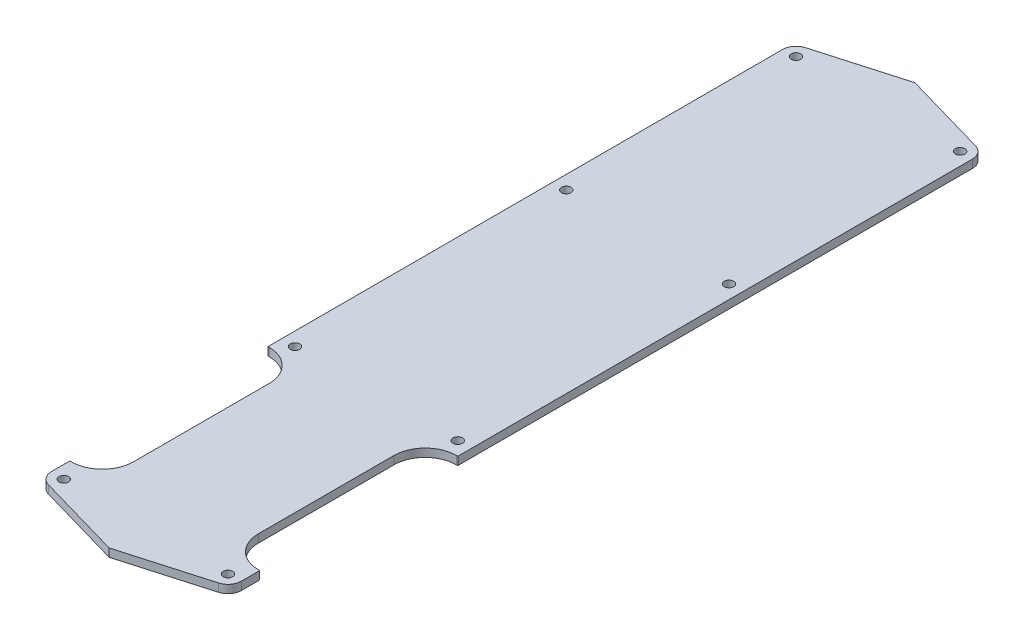
ISO-10303-21;
HEADER;
FILE_DESCRIPTION(('STEP AP214'),'2;1');
FILE_NAME('part.step','',(''),(''),'','','');
FILE_SCHEMA(('AUTOMOTIVE_DESIGN { 1 0 10303 214 1 1 1 1 }'));
ENDSEC;
DATA;
#1=APPLICATION_CONTEXT('core data for automotive mechanical design processes');
#2=APPLICATION_PROTOCOL_DEFINITION('international standard','automotive_design',2000,#1);
#3=PRODUCT_CONTEXT('',#1,'mechanical');
#4=PRODUCT('Part','Part','',(#3));
#5=PRODUCT_RELATED_PRODUCT_CATEGORY('part','',(#4));
#6=PRODUCT_DEFINITION_FORMATION('','',#4);
#7=PRODUCT_DEFINITION_CONTEXT('part definition',#1,'design');
#8=PRODUCT_DEFINITION('design','',#6,#7);
#9=PRODUCT_DEFINITION_SHAPE('','',#8);
#10=(LENGTH_UNIT() NAMED_UNIT(*) SI_UNIT(.MILLI.,.METRE.));
#11=(NAMED_UNIT(*) PLANE_ANGLE_UNIT() SI_UNIT($,.RADIAN.));
#12=(NAMED_UNIT(*) SI_UNIT($,.STERADIAN.) SOLID_ANGLE_UNIT());
#13=UNCERTAINTY_MEASURE_WITH_UNIT(LENGTH_MEASURE(1.E-05),#10,'distance_accuracy_value','');
#14=(GEOMETRIC_REPRESENTATION_CONTEXT(3) GLOBAL_UNCERTAINTY_ASSIGNED_CONTEXT((#13)) GLOBAL_UNIT_ASSIGNED_CONTEXT((#10,
#11,#12)) REPRESENTATION_CONTEXT('',''));
#15=CARTESIAN_POINT('',(0.,0.,0.));
#16=DIRECTION('',(0.,0.,1.));
#17=DIRECTION('',(1.,0.,0.));
#18=AXIS2_PLACEMENT_3D('',#15,#16,#17);
#19=CARTESIAN_POINT('',(-31.378186779085,2.5,-139.538538229178));
#20=DIRECTION('',(-0.275637355817003,0.,-0.961261695938318));
#21=DIRECTION('',(-0.961261695938318,0.,0.275637355817003));
#22=AXIS2_PLACEMENT_3D('',#19,#20,#21);
#23=PLANE('',#22);
#24=DIRECTION('',(0.,-1.,0.));
#25=VECTOR('',#24,1.);
#26=CARTESIAN_POINT('',(-31.378186779085,2.5,-139.538538229178));
#27=LINE('',#26,#25);
#28=CARTESIAN_POINT('',(-31.378186779085,1.5,-139.538538229178));
#29=VERTEX_POINT('',#28);
#30=CARTESIAN_POINT('',(-31.378186779085,-1.5,-139.538538229178));
#31=VERTEX_POINT('',#30);
#32=EDGE_CURVE('E11',#29,#31,#27,.T.);
#33=ORIENTED_EDGE('',*,*,#32,.F.);
#34=DIRECTION('',(0.961261695938318,0.,-0.275637355817003));
#35=VECTOR('',#34,1.);
#36=CARTESIAN_POINT('',(-31.378186779085,1.5,-139.538538229178));
#37=LINE('',#36,#35);
#38=CARTESIAN_POINT('',(0.,1.5,-148.536088501558));
#39=VERTEX_POINT('',#38);
#40=EDGE_CURVE('E197',#29,#39,#37,.T.);
#41=ORIENTED_EDGE('',*,*,#40,.T.);
#42=DIRECTION('',(0.,-1.,0.));
#43=VECTOR('',#42,1.);
#44=CARTESIAN_POINT('',(0.,2.5,-148.536088501558));
#45=LINE('',#44,#43);
#46=CARTESIAN_POINT('',(0.,-1.5,-148.536088501558));
#47=VERTEX_POINT('',#46);
#48=EDGE_CURVE('E205',#39,#47,#45,.T.);
#49=ORIENTED_EDGE('',*,*,#48,.T.);
#50=DIRECTION('',(0.961261695938318,0.,-0.275637355817003));
#51=VECTOR('',#50,1.);
#52=CARTESIAN_POINT('',(-31.378186779085,-1.5,-139.538538229178));
#53=LINE('',#52,#51);
#54=EDGE_CURVE('E360',#31,#47,#53,.T.);
#55=ORIENTED_EDGE('',*,*,#54,.F.);
#56=EDGE_LOOP('',(#33,#41,#49,#55));
#57=FACE_BOUND('',#56,.T.);
#58=ADVANCED_FACE('F43',(#57),#23,.T.);
#59=CARTESIAN_POINT('',(-30.,2.5,-134.732229749486));
#60=DIRECTION('',(0.,-1.,0.));
#61=DIRECTION('',(0.,0.,-1.));
#62=AXIS2_PLACEMENT_3D('',#59,#60,#61);
#63=CYLINDRICAL_SURFACE('',#62,5.00000000000001);
#64=DIRECTION('',(0.,-1.,0.));
#65=VECTOR('',#64,1.);
#66=CARTESIAN_POINT('',(-35.,2.5,-134.732229749486));
#67=LINE('',#66,#65);
#68=CARTESIAN_POINT('',(-35.,1.5,-134.732229749486));
#69=VERTEX_POINT('',#68);
#70=CARTESIAN_POINT('',(-35.,-1.5,-134.732229749486));
#71=VERTEX_POINT('',#70);
#72=EDGE_CURVE('E52',#69,#71,#67,.T.);
#73=ORIENTED_EDGE('',*,*,#72,.F.);
#74=CARTESIAN_POINT('',(-30.,1.5,-134.732229749486));
#75=DIRECTION('',(0.,1.,0.));
#76=DIRECTION('',(0.,0.,1.));
#77=AXIS2_PLACEMENT_3D('',#74,#75,#76);
#78=CIRCLE('',#77,5.00000000000001);
#79=EDGE_CURVE('E209',#69,#29,#78,.F.);
#80=ORIENTED_EDGE('',*,*,#79,.T.);
#81=ORIENTED_EDGE('',*,*,#32,.T.);
#82=CARTESIAN_POINT('',(-30.,-1.5,-134.732229749486));
#83=DIRECTION('',(0.,-1.,0.));
#84=DIRECTION('',(0.,0.,-1.));
#85=AXIS2_PLACEMENT_3D('',#82,#83,#84);
#86=CIRCLE('',#85,5.00000000000001);
#87=EDGE_CURVE('E217',#71,#31,#86,.T.);
#88=ORIENTED_EDGE('',*,*,#87,.F.);
#89=EDGE_LOOP('',(#73,#80,#81,#88));
#90=FACE_BOUND('',#89,.T.);
#91=ADVANCED_FACE('F517',(#90),#63,.T.);
#92=CARTESIAN_POINT('',(-35.,2.5,55.));
#93=DIRECTION('',(-1.,0.,0.));
#94=DIRECTION('',(0.,0.,1.));
#95=AXIS2_PLACEMENT_3D('',#92,#93,#94);
#96=PLANE('',#95);
#97=DIRECTION('',(0.,-1.,0.));
#98=VECTOR('',#97,1.);
#99=CARTESIAN_POINT('',(-35.,2.5,55.));
#100=LINE('',#99,#98);
#101=CARTESIAN_POINT('',(-35.,1.5,55.));
#102=VERTEX_POINT('',#101);
#103=CARTESIAN_POINT('',(-35.,-1.5,55.));
#104=VERTEX_POINT('',#103);
#105=EDGE_CURVE('E277',#102,#104,#100,.T.);
#106=ORIENTED_EDGE('',*,*,#105,.F.);
#107=DIRECTION('',(0.,0.,-1.));
#108=VECTOR('',#107,1.);
#109=CARTESIAN_POINT('',(-35.,1.5,55.));
#110=LINE('',#109,#108);
#111=EDGE_CURVE('E396',#102,#69,#110,.T.);
#112=ORIENTED_EDGE('',*,*,#111,.T.);
#113=ORIENTED_EDGE('',*,*,#72,.T.);
#114=DIRECTION('',(0.,0.,-1.));
#115=VECTOR('',#114,1.);
#116=CARTESIAN_POINT('',(-35.,-1.5,-128.));
#117=LINE('',#116,#115);
#118=EDGE_CURVE('E223',#104,#71,#117,.T.);
#119=ORIENTED_EDGE('',*,*,#118,.F.);
#120=EDGE_LOOP('',(#106,#112,#113,#119));
#121=FACE_BOUND('',#120,.T.);
#122=ADVANCED_FACE('F521',(#121),#96,.T.);
#123=CARTESIAN_POINT('',(-34.5,2.5,55.));
#124=DIRECTION('',(0.,0.,1.));
#125=DIRECTION('',(1.,0.,0.));
#126=AXIS2_PLACEMENT_3D('',#123,#124,#125);
#127=PLANE('',#126);
#128=DIRECTION('',(0.,-1.,0.));
#129=VECTOR('',#128,1.);
#130=CARTESIAN_POINT('',(-34.5,2.5,55.));
#131=LINE('',#130,#129);
#132=CARTESIAN_POINT('',(-34.5,1.5,55.));
#133=VERTEX_POINT('',#132);
#134=CARTESIAN_POINT('',(-34.5,-1.5,55.));
#135=VERTEX_POINT('',#134);
#136=EDGE_CURVE('E274',#133,#135,#131,.T.);
#137=ORIENTED_EDGE('',*,*,#136,.F.);
#138=DIRECTION('',(-1.,0.,0.));
#139=VECTOR('',#138,1.);
#140=CARTESIAN_POINT('',(-34.5,1.5,55.));
#141=LINE('',#140,#139);
#142=EDGE_CURVE('E399',#133,#102,#141,.T.);
#143=ORIENTED_EDGE('',*,*,#142,.T.);
#144=ORIENTED_EDGE('',*,*,#105,.T.);
#145=DIRECTION('',(-1.,0.,0.));
#146=VECTOR('',#145,1.);
#147=CARTESIAN_POINT('',(-34.5,-1.5,55.));
#148=LINE('',#147,#146);
#149=EDGE_CURVE('E286',#135,#104,#148,.T.);
#150=ORIENTED_EDGE('',*,*,#149,.F.);
#151=EDGE_LOOP('',(#137,#143,#144,#150));
#152=FACE_BOUND('',#151,.T.);
#153=ADVANCED_FACE('F526',(#152),#127,.T.);
#154=CARTESIAN_POINT('',(-34.5,2.5,66.5));
#155=DIRECTION('',(0.,-1.,0.));
#156=DIRECTION('',(0.,0.,-1.));
#157=AXIS2_PLACEMENT_3D('',#154,#155,#156);
#158=CYLINDRICAL_SURFACE('',#157,11.5);
#159=DIRECTION('',(0.,-1.,0.));
#160=VECTOR('',#159,1.);
#161=CARTESIAN_POINT('',(-23.,2.5,66.5));
#162=LINE('',#161,#160);
#163=CARTESIAN_POINT('',(-23.,1.5,66.5));
#164=VERTEX_POINT('',#163);
#165=CARTESIAN_POINT('',(-23.,-1.5,66.5));
#166=VERTEX_POINT('',#165);
#167=EDGE_CURVE('E271',#164,#166,#162,.T.);
#168=ORIENTED_EDGE('',*,*,#167,.F.);
#169=CARTESIAN_POINT('',(-34.5,1.5,66.5));
#170=DIRECTION('',(0.,1.,0.));
#171=DIRECTION('',(0.,0.,1.));
#172=AXIS2_PLACEMENT_3D('',#169,#170,#171);
#173=CIRCLE('',#172,11.5);
#174=EDGE_CURVE('E403',#164,#133,#173,.T.);
#175=ORIENTED_EDGE('',*,*,#174,.T.);
#176=ORIENTED_EDGE('',*,*,#136,.T.);
#177=CARTESIAN_POINT('',(-34.5,-1.5,66.5));
#178=DIRECTION('',(0.,1.,0.));
#179=DIRECTION('',(0.,0.,1.));
#180=AXIS2_PLACEMENT_3D('',#177,#178,#179);
#181=CIRCLE('',#180,11.5);
#182=EDGE_CURVE('E290',#166,#135,#181,.T.);
#183=ORIENTED_EDGE('',*,*,#182,.F.);
#184=EDGE_LOOP('',(#168,#175,#176,#183));
#185=FACE_BOUND('',#184,.T.);
#186=ADVANCED_FACE('F534',(#185),#158,.F.);
#187=CARTESIAN_POINT('',(-23.,2.5,116.5));
#188=DIRECTION('',(-1.,0.,0.));
#189=DIRECTION('',(0.,0.,1.));
#190=AXIS2_PLACEMENT_3D('',#187,#188,#189);
#191=PLANE('',#190);
#192=DIRECTION('',(0.,-1.,0.));
#193=VECTOR('',#192,1.);
#194=CARTESIAN_POINT('',(-23.,2.5,116.5));
#195=LINE('',#194,#193);
#196=CARTESIAN_POINT('',(-23.,1.5,116.5));
#197=VERTEX_POINT('',#196);
#198=CARTESIAN_POINT('',(-23.,-1.5,116.5));
#199=VERTEX_POINT('',#198);
#200=EDGE_CURVE('E268',#197,#199,#195,.T.);
#201=ORIENTED_EDGE('',*,*,#200,.F.);
#202=DIRECTION('',(0.,0.,-1.));
#203=VECTOR('',#202,1.);
#204=CARTESIAN_POINT('',(-23.,1.5,116.5));
#205=LINE('',#204,#203);
#206=EDGE_CURVE('E407',#197,#164,#205,.T.);
#207=ORIENTED_EDGE('',*,*,#206,.T.);
#208=ORIENTED_EDGE('',*,*,#167,.T.);
#209=DIRECTION('',(0.,0.,-1.));
#210=VECTOR('',#209,1.);
#211=CARTESIAN_POINT('',(-23.,-1.5,116.5));
#212=LINE('',#211,#210);
#213=EDGE_CURVE('E294',#199,#166,#212,.T.);
#214=ORIENTED_EDGE('',*,*,#213,.F.);
#215=EDGE_LOOP('',(#201,#207,#208,#214));
#216=FACE_BOUND('',#215,.T.);
#217=ADVANCED_FACE('F538',(#216),#191,.T.);
#218=CARTESIAN_POINT('',(-34.5,2.5,116.5));
#219=DIRECTION('',(0.,-1.,0.));
#220=DIRECTION('',(0.,0.,-1.));
#221=AXIS2_PLACEMENT_3D('',#218,#219,#220);
#222=CYLINDRICAL_SURFACE('',#221,11.5);
#223=DIRECTION('',(0.,-1.,0.));
#224=VECTOR('',#223,1.);
#225=CARTESIAN_POINT('',(-34.5000000000007,2.5,128.));
#226=LINE('',#225,#224);
#227=CARTESIAN_POINT('',(-34.5000000000007,1.5,128.));
#228=VERTEX_POINT('',#227);
#229=CARTESIAN_POINT('',(-34.5000000000007,-1.5,128.));
#230=VERTEX_POINT('',#229);
#231=EDGE_CURVE('E265',#228,#230,#226,.T.);
#232=ORIENTED_EDGE('',*,*,#231,.F.);
#233=CARTESIAN_POINT('',(-34.5,1.5,116.5));
#234=DIRECTION('',(0.,1.,0.));
#235=DIRECTION('',(0.,0.,1.));
#236=AXIS2_PLACEMENT_3D('',#233,#234,#235);
#237=CIRCLE('',#236,11.5);
#238=EDGE_CURVE('E411',#228,#197,#237,.T.);
#239=ORIENTED_EDGE('',*,*,#238,.T.);
#240=ORIENTED_EDGE('',*,*,#200,.T.);
#241=CARTESIAN_POINT('',(-34.5,-1.5,116.5));
#242=DIRECTION('',(0.,1.,0.));
#243=DIRECTION('',(0.,0.,1.));
#244=AXIS2_PLACEMENT_3D('',#241,#242,#243);
#245=CIRCLE('',#244,11.5);
#246=EDGE_CURVE('E298',#230,#199,#245,.T.);
#247=ORIENTED_EDGE('',*,*,#246,.F.);
#248=EDGE_LOOP('',(#232,#239,#240,#247));
#249=FACE_BOUND('',#248,.T.);
#250=ADVANCED_FACE('F542',(#249),#222,.F.);
#251=CARTESIAN_POINT('',(-35.,2.5,128.));
#252=DIRECTION('',(0.,0.,-1.));
#253=DIRECTION('',(-1.,0.,0.));
#254=AXIS2_PLACEMENT_3D('',#251,#252,#253);
#255=PLANE('',#254);
#256=DIRECTION('',(0.,-1.,0.));
#257=VECTOR('',#256,1.);
#258=CARTESIAN_POINT('',(-35.,2.5,128.));
#259=LINE('',#258,#257);
#260=CARTESIAN_POINT('',(-35.,1.5,128.));
#261=VERTEX_POINT('',#260);
#262=CARTESIAN_POINT('',(-35.,-1.5,128.));
#263=VERTEX_POINT('',#262);
#264=EDGE_CURVE('E262',#261,#263,#259,.T.);
#265=ORIENTED_EDGE('',*,*,#264,.F.);
#266=DIRECTION('',(1.,0.,0.));
#267=VECTOR('',#266,1.);
#268=CARTESIAN_POINT('',(-35.,1.5,128.));
#269=LINE('',#268,#267);
#270=EDGE_CURVE('E415',#261,#228,#269,.T.);
#271=ORIENTED_EDGE('',*,*,#270,.T.);
#272=ORIENTED_EDGE('',*,*,#231,.T.);
#273=DIRECTION('',(1.,0.,0.));
#274=VECTOR('',#273,1.);
#275=CARTESIAN_POINT('',(-35.,-1.5,128.));
#276=LINE('',#275,#274);
#277=EDGE_CURVE('E302',#263,#230,#276,.T.);
#278=ORIENTED_EDGE('',*,*,#277,.F.);
#279=EDGE_LOOP('',(#265,#271,#272,#278));
#280=FACE_BOUND('',#279,.T.);
#281=ADVANCED_FACE('F546',(#280),#255,.T.);
#282=CARTESIAN_POINT('',(-35.,2.5,134.732229749486));
#283=DIRECTION('',(-1.,0.,0.));
#284=DIRECTION('',(0.,0.,1.));
#285=AXIS2_PLACEMENT_3D('',#282,#283,#284);
#286=PLANE('',#285);
#287=DIRECTION('',(0.,-1.,0.));
#288=VECTOR('',#287,1.);
#289=CARTESIAN_POINT('',(-35.,2.5,134.732229749486));
#290=LINE('',#289,#288);
#291=CARTESIAN_POINT('',(-35.,1.5,134.732229749486));
#292=VERTEX_POINT('',#291);
#293=CARTESIAN_POINT('',(-35.,-1.5,134.732229749486));
#294=VERTEX_POINT('',#293);
#295=EDGE_CURVE('E259',#292,#294,#290,.T.);
#296=ORIENTED_EDGE('',*,*,#295,.F.);
#297=DIRECTION('',(0.,0.,-1.));
#298=VECTOR('',#297,1.);
#299=CARTESIAN_POINT('',(-35.,1.5,134.732229749486));
#300=LINE('',#299,#298);
#301=EDGE_CURVE('E419',#292,#261,#300,.T.);
#302=ORIENTED_EDGE('',*,*,#301,.T.);
#303=ORIENTED_EDGE('',*,*,#264,.T.);
#304=DIRECTION('',(0.,0.,-1.));
#305=VECTOR('',#304,1.);
#306=CARTESIAN_POINT('',(-35.,-1.5,134.732229749486));
#307=LINE('',#306,#305);
#308=EDGE_CURVE('E306',#294,#263,#307,.T.);
#309=ORIENTED_EDGE('',*,*,#308,.F.);
#310=EDGE_LOOP('',(#296,#302,#303,#309));
#311=FACE_BOUND('',#310,.T.);
#312=ADVANCED_FACE('F550',(#311),#286,.T.);
#313=CARTESIAN_POINT('',(-30.,2.5,134.732229749486));
#314=DIRECTION('',(0.,-1.,0.));
#315=DIRECTION('',(0.,0.,-1.));
#316=AXIS2_PLACEMENT_3D('',#313,#314,#315);
#317=CYLINDRICAL_SURFACE('',#316,5.00000000000001);
#318=DIRECTION('',(0.,-1.,0.));
#319=VECTOR('',#318,1.);
#320=CARTESIAN_POINT('',(-31.378186779085,2.5,139.538538229178));
#321=LINE('',#320,#319);
#322=CARTESIAN_POINT('',(-31.378186779085,1.5,139.538538229178));
#323=VERTEX_POINT('',#322);
#324=CARTESIAN_POINT('',(-31.378186779085,-1.5,139.538538229178));
#325=VERTEX_POINT('',#324);
#326=EDGE_CURVE('E256',#323,#325,#321,.T.);
#327=ORIENTED_EDGE('',*,*,#326,.F.);
#328=CARTESIAN_POINT('',(-30.,1.5,134.732229749486));
#329=DIRECTION('',(0.,1.,0.));
#330=DIRECTION('',(0.,0.,1.));
#331=AXIS2_PLACEMENT_3D('',#328,#329,#330);
#332=CIRCLE('',#331,5.00000000000001);
#333=EDGE_CURVE('E423',#323,#292,#332,.F.);
#334=ORIENTED_EDGE('',*,*,#333,.T.);
#335=ORIENTED_EDGE('',*,*,#295,.T.);
#336=CARTESIAN_POINT('',(-30.,-1.5,134.732229749486));
#337=DIRECTION('',(0.,-1.,0.));
#338=DIRECTION('',(0.,0.,-1.));
#339=AXIS2_PLACEMENT_3D('',#336,#337,#338);
#340=CIRCLE('',#339,5.00000000000001);
#341=EDGE_CURVE('E310',#325,#294,#340,.T.);
#342=ORIENTED_EDGE('',*,*,#341,.F.);
#343=EDGE_LOOP('',(#327,#334,#335,#342));
#344=FACE_BOUND('',#343,.T.);
#345=ADVANCED_FACE('F554',(#344),#317,.T.);
#346=CARTESIAN_POINT('',(0.,2.5,148.536088501558));
#347=DIRECTION('',(-0.275637355817003,0.,0.961261695938318));
#348=DIRECTION('',(0.961261695938318,0.,0.275637355817003));
#349=AXIS2_PLACEMENT_3D('',#346,#347,#348);
#350=PLANE('',#349);
#351=DIRECTION('',(0.,-1.,0.));
#352=VECTOR('',#351,1.);
#353=CARTESIAN_POINT('',(0.,2.5,148.536088501558));
#354=LINE('',#353,#352);
#355=CARTESIAN_POINT('',(0.,1.5,148.536088501558));
#356=VERTEX_POINT('',#355);
#357=CARTESIAN_POINT('',(0.,-1.5,148.536088501558));
#358=VERTEX_POINT('',#357);
#359=EDGE_CURVE('E253',#356,#358,#354,.T.);
#360=ORIENTED_EDGE('',*,*,#359,.F.);
#361=DIRECTION('',(-0.961261695938318,0.,-0.275637355817003));
#362=VECTOR('',#361,1.);
#363=CARTESIAN_POINT('',(0.,1.5,148.536088501558));
#364=LINE('',#363,#362);
#365=EDGE_CURVE('E427',#356,#323,#364,.T.);
#366=ORIENTED_EDGE('',*,*,#365,.T.);
#367=ORIENTED_EDGE('',*,*,#326,.T.);
#368=DIRECTION('',(-0.961261695938318,0.,-0.275637355817003));
#369=VECTOR('',#368,1.);
#370=CARTESIAN_POINT('',(0.,-1.5,148.536088501558));
#371=LINE('',#370,#369);
#372=EDGE_CURVE('E314',#358,#325,#371,.T.);
#373=ORIENTED_EDGE('',*,*,#372,.F.);
#374=EDGE_LOOP('',(#360,#366,#367,#373));
#375=FACE_BOUND('',#374,.T.);
#376=ADVANCED_FACE('F558',(#375),#350,.T.);
#377=CARTESIAN_POINT('',(31.378186779085,2.5,139.538538229178));
#378=DIRECTION('',(0.275637355817003,0.,0.961261695938318));
#379=DIRECTION('',(0.961261695938318,0.,-0.275637355817003));
#380=AXIS2_PLACEMENT_3D('',#377,#378,#379);
#381=PLANE('',#380);
#382=DIRECTION('',(0.,-1.,0.));
#383=VECTOR('',#382,1.);
#384=CARTESIAN_POINT('',(31.378186779085,2.5,139.538538229178));
#385=LINE('',#384,#383);
#386=CARTESIAN_POINT('',(31.378186779085,1.5,139.538538229178));
#387=VERTEX_POINT('',#386);
#388=CARTESIAN_POINT('',(31.378186779085,-1.5,139.538538229178));
#389=VERTEX_POINT('',#388);
#390=EDGE_CURVE('E250',#387,#389,#385,.T.);
#391=ORIENTED_EDGE('',*,*,#390,.F.);
#392=DIRECTION('',(-0.961261695938318,0.,0.275637355817003));
#393=VECTOR('',#392,1.);
#394=CARTESIAN_POINT('',(31.378186779085,1.5,139.538538229178));
#395=LINE('',#394,#393);
#396=EDGE_CURVE('E431',#387,#356,#395,.T.);
#397=ORIENTED_EDGE('',*,*,#396,.T.);
#398=ORIENTED_EDGE('',*,*,#359,.T.);
#399=DIRECTION('',(-0.961261695938318,0.,0.275637355817003));
#400=VECTOR('',#399,1.);
#401=CARTESIAN_POINT('',(31.378186779085,-1.5,139.538538229178));
#402=LINE('',#401,#400);
#403=EDGE_CURVE('E318',#389,#358,#402,.T.);
#404=ORIENTED_EDGE('',*,*,#403,.F.);
#405=EDGE_LOOP('',(#391,#397,#398,#404));
#406=FACE_BOUND('',#405,.T.);
#407=ADVANCED_FACE('F562',(#406),#381,.T.);
#408=CARTESIAN_POINT('',(30.,2.5,134.732229749486));
#409=DIRECTION('',(0.,-1.,0.));
#410=DIRECTION('',(0.,0.,-1.));
#411=AXIS2_PLACEMENT_3D('',#408,#409,#410);
#412=CYLINDRICAL_SURFACE('',#411,5.00000000000001);
#413=DIRECTION('',(0.,-1.,0.));
#414=VECTOR('',#413,1.);
#415=CARTESIAN_POINT('',(35.,2.5,134.732229749486));
#416=LINE('',#415,#414);
#417=CARTESIAN_POINT('',(35.,1.5,134.732229749486));
#418=VERTEX_POINT('',#417);
#419=CARTESIAN_POINT('',(35.,-1.5,134.732229749486));
#420=VERTEX_POINT('',#419);
#421=EDGE_CURVE('E247',#418,#420,#416,.T.);
#422=ORIENTED_EDGE('',*,*,#421,.F.);
#423=CARTESIAN_POINT('',(30.,1.5,134.732229749486));
#424=DIRECTION('',(0.,1.,0.));
#425=DIRECTION('',(0.,0.,1.));
#426=AXIS2_PLACEMENT_3D('',#423,#424,#425);
#427=CIRCLE('',#426,5.00000000000001);
#428=EDGE_CURVE('E435',#418,#387,#427,.F.);
#429=ORIENTED_EDGE('',*,*,#428,.T.);
#430=ORIENTED_EDGE('',*,*,#390,.T.);
#431=CARTESIAN_POINT('',(30.,-1.5,134.732229749486));
#432=DIRECTION('',(0.,-1.,0.));
#433=DIRECTION('',(0.,0.,-1.));
#434=AXIS2_PLACEMENT_3D('',#431,#432,#433);
#435=CIRCLE('',#434,5.00000000000001);
#436=EDGE_CURVE('E322',#420,#389,#435,.T.);
#437=ORIENTED_EDGE('',*,*,#436,.F.);
#438=EDGE_LOOP('',(#422,#429,#430,#437));
#439=FACE_BOUND('',#438,.T.);
#440=ADVANCED_FACE('F566',(#439),#412,.T.);
#441=CARTESIAN_POINT('',(35.,2.5,128.));
#442=DIRECTION('',(1.,0.,0.));
#443=DIRECTION('',(0.,0.,-1.));
#444=AXIS2_PLACEMENT_3D('',#441,#442,#443);
#445=PLANE('',#444);
#446=DIRECTION('',(0.,-1.,0.));
#447=VECTOR('',#446,1.);
#448=CARTESIAN_POINT('',(35.,2.5,128.));
#449=LINE('',#448,#447);
#450=CARTESIAN_POINT('',(35.,1.5,128.));
#451=VERTEX_POINT('',#450);
#452=CARTESIAN_POINT('',(35.,-1.5,128.));
#453=VERTEX_POINT('',#452);
#454=EDGE_CURVE('E244',#451,#453,#449,.T.);
#455=ORIENTED_EDGE('',*,*,#454,.F.);
#456=DIRECTION('',(0.,0.,1.));
#457=VECTOR('',#456,1.);
#458=CARTESIAN_POINT('',(35.,1.5,128.));
#459=LINE('',#458,#457);
#460=EDGE_CURVE('E439',#451,#418,#459,.T.);
#461=ORIENTED_EDGE('',*,*,#460,.T.);
#462=ORIENTED_EDGE('',*,*,#421,.T.);
#463=DIRECTION('',(0.,0.,1.));
#464=VECTOR('',#463,1.);
#465=CARTESIAN_POINT('',(35.,-1.5,128.));
#466=LINE('',#465,#464);
#467=EDGE_CURVE('E326',#453,#420,#466,.T.);
#468=ORIENTED_EDGE('',*,*,#467,.F.);
#469=EDGE_LOOP('',(#455,#461,#462,#468));
#470=FACE_BOUND('',#469,.T.);
#471=ADVANCED_FACE('F570',(#470),#445,.T.);
#472=CARTESIAN_POINT('',(34.5000000000007,2.5,128.));
#473=DIRECTION('',(0.,0.,-1.));
#474=DIRECTION('',(-1.,0.,0.));
#475=AXIS2_PLACEMENT_3D('',#472,#473,#474);
#476=PLANE('',#475);
#477=DIRECTION('',(0.,-1.,0.));
#478=VECTOR('',#477,1.);
#479=CARTESIAN_POINT('',(34.5,2.5,128.));
#480=LINE('',#479,#478);
#481=CARTESIAN_POINT('',(34.5,1.5,128.));
#482=VERTEX_POINT('',#481);
#483=CARTESIAN_POINT('',(34.5,-1.5,128.));
#484=VERTEX_POINT('',#483);
#485=EDGE_CURVE('E241',#482,#484,#480,.T.);
#486=ORIENTED_EDGE('',*,*,#485,.F.);
#487=DIRECTION('',(1.,0.,0.));
#488=VECTOR('',#487,1.);
#489=CARTESIAN_POINT('',(34.5000000000007,1.5,128.));
#490=LINE('',#489,#488);
#491=EDGE_CURVE('E443',#482,#451,#490,.T.);
#492=ORIENTED_EDGE('',*,*,#491,.T.);
#493=ORIENTED_EDGE('',*,*,#454,.T.);
#494=DIRECTION('',(1.,0.,0.));
#495=VECTOR('',#494,1.);
#496=CARTESIAN_POINT('',(34.5000000000007,-1.5,128.));
#497=LINE('',#496,#495);
#498=EDGE_CURVE('E330',#484,#453,#497,.T.);
#499=ORIENTED_EDGE('',*,*,#498,.F.);
#500=EDGE_LOOP('',(#486,#492,#493,#499));
#501=FACE_BOUND('',#500,.T.);
#502=ADVANCED_FACE('F574',(#501),#476,.T.);
#503=CARTESIAN_POINT('',(34.5,2.5,116.5));
#504=DIRECTION('',(0.,-1.,0.));
#505=DIRECTION('',(0.,0.,-1.));
#506=AXIS2_PLACEMENT_3D('',#503,#504,#505);
#507=CYLINDRICAL_SURFACE('',#506,11.5);
#508=DIRECTION('',(0.,-1.,0.));
#509=VECTOR('',#508,1.);
#510=CARTESIAN_POINT('',(23.,2.5,116.5));
#511=LINE('',#510,#509);
#512=CARTESIAN_POINT('',(23.,1.5,116.5));
#513=VERTEX_POINT('',#512);
#514=CARTESIAN_POINT('',(23.,-1.5,116.5));
#515=VERTEX_POINT('',#514);
#516=EDGE_CURVE('E238',#513,#515,#511,.T.);
#517=ORIENTED_EDGE('',*,*,#516,.F.);
#518=CARTESIAN_POINT('',(34.5,1.5,116.5));
#519=DIRECTION('',(0.,1.,0.));
#520=DIRECTION('',(0.,0.,1.));
#521=AXIS2_PLACEMENT_3D('',#518,#519,#520);
#522=CIRCLE('',#521,11.5);
#523=EDGE_CURVE('E447',#513,#482,#522,.T.);
#524=ORIENTED_EDGE('',*,*,#523,.T.);
#525=ORIENTED_EDGE('',*,*,#485,.T.);
#526=CARTESIAN_POINT('',(34.5,-1.5,116.5));
#527=DIRECTION('',(0.,1.,0.));
#528=DIRECTION('',(0.,0.,1.));
#529=AXIS2_PLACEMENT_3D('',#526,#527,#528);
#530=CIRCLE('',#529,11.5);
#531=EDGE_CURVE('E334',#515,#484,#530,.T.);
#532=ORIENTED_EDGE('',*,*,#531,.F.);
#533=EDGE_LOOP('',(#517,#524,#525,#532));
#534=FACE_BOUND('',#533,.T.);
#535=ADVANCED_FACE('F578',(#534),#507,.F.);
#536=CARTESIAN_POINT('',(23.,2.5,66.5));
#537=DIRECTION('',(1.,0.,0.));
#538=DIRECTION('',(0.,0.,-1.));
#539=AXIS2_PLACEMENT_3D('',#536,#537,#538);
#540=PLANE('',#539);
#541=DIRECTION('',(0.,-1.,0.));
#542=VECTOR('',#541,1.);
#543=CARTESIAN_POINT('',(23.,2.5,66.5));
#544=LINE('',#543,#542);
#545=CARTESIAN_POINT('',(23.,1.5,66.5));
#546=VERTEX_POINT('',#545);
#547=CARTESIAN_POINT('',(23.,-1.5,66.5));
#548=VERTEX_POINT('',#547);
#549=EDGE_CURVE('E235',#546,#548,#544,.T.);
#550=ORIENTED_EDGE('',*,*,#549,.F.);
#551=DIRECTION('',(0.,0.,1.));
#552=VECTOR('',#551,1.);
#553=CARTESIAN_POINT('',(23.,1.5,66.5));
#554=LINE('',#553,#552);
#555=EDGE_CURVE('E451',#546,#513,#554,.T.);
#556=ORIENTED_EDGE('',*,*,#555,.T.);
#557=ORIENTED_EDGE('',*,*,#516,.T.);
#558=DIRECTION('',(0.,0.,1.));
#559=VECTOR('',#558,1.);
#560=CARTESIAN_POINT('',(23.,-1.5,66.5));
#561=LINE('',#560,#559);
#562=EDGE_CURVE('E338',#548,#515,#561,.T.);
#563=ORIENTED_EDGE('',*,*,#562,.F.);
#564=EDGE_LOOP('',(#550,#556,#557,#563));
#565=FACE_BOUND('',#564,.T.);
#566=ADVANCED_FACE('F582',(#565),#540,.T.);
#567=CARTESIAN_POINT('',(34.5,2.5,66.5));
#568=DIRECTION('',(0.,-1.,0.));
#569=DIRECTION('',(0.,0.,-1.));
#570=AXIS2_PLACEMENT_3D('',#567,#568,#569);
#571=CYLINDRICAL_SURFACE('',#570,11.5);
#572=DIRECTION('',(0.,-1.,0.));
#573=VECTOR('',#572,1.);
#574=CARTESIAN_POINT('',(34.5000000000013,2.5,55.));
#575=LINE('',#574,#573);
#576=CARTESIAN_POINT('',(34.5000000000013,1.5,55.));
#577=VERTEX_POINT('',#576);
#578=CARTESIAN_POINT('',(34.5000000000013,-1.5,55.));
#579=VERTEX_POINT('',#578);
#580=EDGE_CURVE('E232',#577,#579,#575,.T.);
#581=ORIENTED_EDGE('',*,*,#580,.F.);
#582=CARTESIAN_POINT('',(34.5,1.5,66.5));
#583=DIRECTION('',(0.,1.,0.));
#584=DIRECTION('',(0.,0.,1.));
#585=AXIS2_PLACEMENT_3D('',#582,#583,#584);
#586=CIRCLE('',#585,11.5);
#587=EDGE_CURVE('E455',#577,#546,#586,.T.);
#588=ORIENTED_EDGE('',*,*,#587,.T.);
#589=ORIENTED_EDGE('',*,*,#549,.T.);
#590=CARTESIAN_POINT('',(34.5,-1.5,66.5));
#591=DIRECTION('',(0.,1.,0.));
#592=DIRECTION('',(0.,0.,1.));
#593=AXIS2_PLACEMENT_3D('',#590,#591,#592);
#594=CIRCLE('',#593,11.5);
#595=EDGE_CURVE('E342',#579,#548,#594,.T.);
#596=ORIENTED_EDGE('',*,*,#595,.F.);
#597=EDGE_LOOP('',(#581,#588,#589,#596));
#598=FACE_BOUND('',#597,.T.);
#599=ADVANCED_FACE('F586',(#598),#571,.F.);
#600=CARTESIAN_POINT('',(35.,2.5,55.));
#601=DIRECTION('',(0.,0.,1.));
#602=DIRECTION('',(1.,0.,0.));
#603=AXIS2_PLACEMENT_3D('',#600,#601,#602);
#604=PLANE('',#603);
#605=DIRECTION('',(0.,-1.,0.));
#606=VECTOR('',#605,1.);
#607=CARTESIAN_POINT('',(35.,2.5,55.));
#608=LINE('',#607,#606);
#609=CARTESIAN_POINT('',(35.,1.5,55.));
#610=VERTEX_POINT('',#609);
#611=CARTESIAN_POINT('',(35.,-1.5,55.));
#612=VERTEX_POINT('',#611);
#613=EDGE_CURVE('E229',#610,#612,#608,.T.);
#614=ORIENTED_EDGE('',*,*,#613,.F.);
#615=DIRECTION('',(-1.,0.,0.));
#616=VECTOR('',#615,1.);
#617=CARTESIAN_POINT('',(35.,1.5,55.));
#618=LINE('',#617,#616);
#619=EDGE_CURVE('E459',#610,#577,#618,.T.);
#620=ORIENTED_EDGE('',*,*,#619,.T.);
#621=ORIENTED_EDGE('',*,*,#580,.T.);
#622=DIRECTION('',(-1.,0.,0.));
#623=VECTOR('',#622,1.);
#624=CARTESIAN_POINT('',(35.,-1.5,55.));
#625=LINE('',#624,#623);
#626=EDGE_CURVE('E346',#612,#579,#625,.T.);
#627=ORIENTED_EDGE('',*,*,#626,.F.);
#628=EDGE_LOOP('',(#614,#620,#621,#627));
#629=FACE_BOUND('',#628,.T.);
#630=ADVANCED_FACE('F590',(#629),#604,.T.);
#631=CARTESIAN_POINT('',(35.,2.5,-134.732229749486));
#632=DIRECTION('',(1.,0.,0.));
#633=DIRECTION('',(0.,0.,-1.));
#634=AXIS2_PLACEMENT_3D('',#631,#632,#633);
#635=PLANE('',#634);
#636=DIRECTION('',(0.,-1.,0.));
#637=VECTOR('',#636,1.);
#638=CARTESIAN_POINT('',(35.,2.5,-134.732229749486));
#639=LINE('',#638,#637);
#640=CARTESIAN_POINT('',(35.,1.5,-134.732229749486));
#641=VERTEX_POINT('',#640);
#642=CARTESIAN_POINT('',(35.,-1.5,-134.732229749486));
#643=VERTEX_POINT('',#642);
#644=EDGE_CURVE('E220',#641,#643,#639,.T.);
#645=ORIENTED_EDGE('',*,*,#644,.F.);
#646=DIRECTION('',(0.,0.,1.));
#647=VECTOR('',#646,1.);
#648=CARTESIAN_POINT('',(35.,1.5,-134.732229749486));
#649=LINE('',#648,#647);
#650=EDGE_CURVE('E463',#641,#610,#649,.T.);
#651=ORIENTED_EDGE('',*,*,#650,.T.);
#652=ORIENTED_EDGE('',*,*,#613,.T.);
#653=DIRECTION('',(0.,0.,1.));
#654=VECTOR('',#653,1.);
#655=CARTESIAN_POINT('',(35.,-1.5,-55.));
#656=LINE('',#655,#654);
#657=EDGE_CURVE('E350',#643,#612,#656,.T.);
#658=ORIENTED_EDGE('',*,*,#657,.F.);
#659=EDGE_LOOP('',(#645,#651,#652,#658));
#660=FACE_BOUND('',#659,.T.);
#661=ADVANCED_FACE('F594',(#660),#635,.T.);
#662=CARTESIAN_POINT('',(30.,2.5,-134.732229749486));
#663=DIRECTION('',(0.,-1.,0.));
#664=DIRECTION('',(0.,0.,-1.));
#665=AXIS2_PLACEMENT_3D('',#662,#663,#664);
#666=CYLINDRICAL_SURFACE('',#665,5.00000000000001);
#667=DIRECTION('',(0.,-1.,0.));
#668=VECTOR('',#667,1.);
#669=CARTESIAN_POINT('',(31.378186779085,2.5,-139.538538229178));
#670=LINE('',#669,#668);
#671=CARTESIAN_POINT('',(31.378186779085,1.5,-139.538538229178));
#672=VERTEX_POINT('',#671);
#673=CARTESIAN_POINT('',(31.378186779085,-1.5,-139.538538229178));
#674=VERTEX_POINT('',#673);
#675=EDGE_CURVE('E216',#672,#674,#670,.T.);
#676=ORIENTED_EDGE('',*,*,#675,.F.);
#677=CARTESIAN_POINT('',(30.,1.5,-134.732229749486));
#678=DIRECTION('',(0.,1.,0.));
#679=DIRECTION('',(0.,0.,1.));
#680=AXIS2_PLACEMENT_3D('',#677,#678,#679);
#681=CIRCLE('',#680,5.00000000000001);
#682=EDGE_CURVE('E60',#672,#641,#681,.F.);
#683=ORIENTED_EDGE('',*,*,#682,.T.);
#684=ORIENTED_EDGE('',*,*,#644,.T.);
#685=CARTESIAN_POINT('',(30.,-1.5,-134.732229749486));
#686=DIRECTION('',(0.,-1.,0.));
#687=DIRECTION('',(0.,0.,-1.));
#688=AXIS2_PLACEMENT_3D('',#685,#686,#687);
#689=CIRCLE('',#688,5.00000000000001);
#690=EDGE_CURVE('E354',#674,#643,#689,.T.);
#691=ORIENTED_EDGE('',*,*,#690,.F.);
#692=EDGE_LOOP('',(#676,#683,#684,#691));
#693=FACE_BOUND('',#692,.T.);
#694=ADVANCED_FACE('F598',(#693),#666,.T.);
#695=CARTESIAN_POINT('',(0.,2.5,-148.536088501558));
#696=DIRECTION('',(0.275637355817003,0.,-0.961261695938318));
#697=DIRECTION('',(-0.961261695938318,0.,-0.275637355817003));
#698=AXIS2_PLACEMENT_3D('',#695,#696,#697);
#699=PLANE('',#698);
#700=ORIENTED_EDGE('',*,*,#48,.F.);
#701=DIRECTION('',(0.961261695938318,0.,0.275637355817003));
#702=VECTOR('',#701,1.);
#703=CARTESIAN_POINT('',(0.,1.5,-148.536088501558));
#704=LINE('',#703,#702);
#705=EDGE_CURVE('E191',#39,#672,#704,.T.);
#706=ORIENTED_EDGE('',*,*,#705,.T.);
#707=ORIENTED_EDGE('',*,*,#675,.T.);
#708=DIRECTION('',(0.961261695938318,0.,0.275637355817003));
#709=VECTOR('',#708,1.);
#710=CARTESIAN_POINT('',(0.,-1.5,-148.536088501558));
#711=LINE('',#710,#709);
#712=EDGE_CURVE('E213',#47,#674,#711,.T.);
#713=ORIENTED_EDGE('',*,*,#712,.F.);
#714=EDGE_LOOP('',(#700,#706,#707,#713));
#715=FACE_BOUND('',#714,.T.);
#716=ADVANCED_FACE('F211',(#715),#699,.T.);
#717=CARTESIAN_POINT('',(-30.25,2.5,134.954028797882));
#718=DIRECTION('',(0.,-1.,0.));
#719=DIRECTION('',(0.,0.,-1.));
#720=AXIS2_PLACEMENT_3D('',#717,#718,#719);
#721=CYLINDRICAL_SURFACE('',#720,1.75);
#722=CARTESIAN_POINT('',(-30.25,-1.5,134.954028797882));
#723=DIRECTION('',(0.,-1.,0.));
#724=DIRECTION('',(0.,0.,1.));
#725=AXIS2_PLACEMENT_3D('',#722,#723,#724);
#726=CIRCLE('',#725,1.75);
#727=CARTESIAN_POINT('',(-30.25,-1.5,136.704028797882));
#728=VERTEX_POINT('',#727);
#729=EDGE_CURVE('E363',#728,#728,#726,.T.);
#730=ORIENTED_EDGE('',*,*,#729,.T.);
#731=EDGE_LOOP('',(#730));
#732=FACE_BOUND('',#731,.T.);
#733=CARTESIAN_POINT('',(-30.25,1.5,134.954028797882));
#734=DIRECTION('',(0.,1.,0.));
#735=DIRECTION('',(0.,0.,1.));
#736=AXIS2_PLACEMENT_3D('',#733,#734,#735);
#737=CIRCLE('',#736,1.75);
#738=CARTESIAN_POINT('',(-30.25,1.5,136.704028797882));
#739=VERTEX_POINT('',#738);
#740=EDGE_CURVE('E202',#739,#739,#737,.F.);
#741=ORIENTED_EDGE('',*,*,#740,.F.);
#742=EDGE_LOOP('',(#741));
#743=FACE_BOUND('',#742,.T.);
#744=ADVANCED_FACE('F603',(#732,#743),#721,.F.);
#745=CARTESIAN_POINT('',(30.,2.5,-50.));
#746=DIRECTION('',(0.,-1.,0.));
#747=DIRECTION('',(0.,0.,-1.));
#748=AXIS2_PLACEMENT_3D('',#745,#746,#747);
#749=CYLINDRICAL_SURFACE('',#748,1.75);
#750=CARTESIAN_POINT('',(30.,-1.5,-50.));
#751=DIRECTION('',(0.,-1.,0.));
#752=DIRECTION('',(0.,0.,1.));
#753=AXIS2_PLACEMENT_3D('',#750,#751,#752);
#754=CIRCLE('',#753,1.75);
#755=CARTESIAN_POINT('',(30.,-1.5,-48.25));
#756=VERTEX_POINT('',#755);
#757=EDGE_CURVE('E367',#756,#756,#754,.T.);
#758=ORIENTED_EDGE('',*,*,#757,.T.);
#759=EDGE_LOOP('',(#758));
#760=FACE_BOUND('',#759,.T.);
#761=CARTESIAN_POINT('',(30.,1.5,-50.));
#762=DIRECTION('',(0.,1.,0.));
#763=DIRECTION('',(0.,0.,1.));
#764=AXIS2_PLACEMENT_3D('',#761,#762,#763);
#765=CIRCLE('',#764,1.75);
#766=CARTESIAN_POINT('',(30.,1.5,-48.25));
#767=VERTEX_POINT('',#766);
#768=EDGE_CURVE('E471',#767,#767,#765,.F.);
#769=ORIENTED_EDGE('',*,*,#768,.F.);
#770=EDGE_LOOP('',(#769));
#771=FACE_BOUND('',#770,.T.);
#772=ADVANCED_FACE('F607',(#760,#771),#749,.F.);
#773=CARTESIAN_POINT('',(-29.9999999999997,2.5,50.));
#774=DIRECTION('',(0.,-1.,0.));
#775=DIRECTION('',(0.,0.,-1.));
#776=AXIS2_PLACEMENT_3D('',#773,#774,#775);
#777=CYLINDRICAL_SURFACE('',#776,1.75);
#778=CARTESIAN_POINT('',(-29.9999999999997,-1.5,50.));
#779=DIRECTION('',(0.,-1.,0.));
#780=DIRECTION('',(0.,0.,1.));
#781=AXIS2_PLACEMENT_3D('',#778,#779,#780);
#782=CIRCLE('',#781,1.75);
#783=CARTESIAN_POINT('',(-29.9999999999997,-1.5,51.75));
#784=VERTEX_POINT('',#783);
#785=EDGE_CURVE('E371',#784,#784,#782,.T.);
#786=ORIENTED_EDGE('',*,*,#785,.T.);
#787=EDGE_LOOP('',(#786));
#788=FACE_BOUND('',#787,.T.);
#789=CARTESIAN_POINT('',(-29.9999999999997,1.5,50.));
#790=DIRECTION('',(0.,1.,0.));
#791=DIRECTION('',(0.,0.,1.));
#792=AXIS2_PLACEMENT_3D('',#789,#790,#791);
#793=CIRCLE('',#792,1.75);
#794=CARTESIAN_POINT('',(-29.9999999999997,1.5,51.75));
#795=VERTEX_POINT('',#794);
#796=EDGE_CURVE('E475',#795,#795,#793,.F.);
#797=ORIENTED_EDGE('',*,*,#796,.F.);
#798=EDGE_LOOP('',(#797));
#799=FACE_BOUND('',#798,.T.);
#800=ADVANCED_FACE('F612',(#788,#799),#777,.F.);
#801=CARTESIAN_POINT('',(30.,2.5,50.));
#802=DIRECTION('',(0.,-1.,0.));
#803=DIRECTION('',(0.,0.,-1.));
#804=AXIS2_PLACEMENT_3D('',#801,#802,#803);
#805=CYLINDRICAL_SURFACE('',#804,1.75);
#806=CARTESIAN_POINT('',(30.,-1.5,50.));
#807=DIRECTION('',(0.,-1.,0.));
#808=DIRECTION('',(0.,0.,1.));
#809=AXIS2_PLACEMENT_3D('',#806,#807,#808);
#810=CIRCLE('',#809,1.75);
#811=CARTESIAN_POINT('',(30.,-1.5,51.75));
#812=VERTEX_POINT('',#811);
#813=EDGE_CURVE('E375',#812,#812,#810,.T.);
#814=ORIENTED_EDGE('',*,*,#813,.T.);
#815=EDGE_LOOP('',(#814));
#816=FACE_BOUND('',#815,.T.);
#817=CARTESIAN_POINT('',(30.,1.5,50.));
#818=DIRECTION('',(0.,1.,0.));
#819=DIRECTION('',(0.,0.,1.));
#820=AXIS2_PLACEMENT_3D('',#817,#818,#819);
#821=CIRCLE('',#820,1.75);
#822=CARTESIAN_POINT('',(30.,1.5,51.75));
#823=VERTEX_POINT('',#822);
#824=EDGE_CURVE('E479',#823,#823,#821,.F.);
#825=ORIENTED_EDGE('',*,*,#824,.F.);
#826=EDGE_LOOP('',(#825));
#827=FACE_BOUND('',#826,.T.);
#828=ADVANCED_FACE('F619',(#816,#827),#805,.F.);
#829=CARTESIAN_POINT('',(30.25,2.5,134.954028797882));
#830=DIRECTION('',(0.,-1.,0.));
#831=DIRECTION('',(0.,0.,-1.));
#832=AXIS2_PLACEMENT_3D('',#829,#830,#831);
#833=CYLINDRICAL_SURFACE('',#832,1.75);
#834=CARTESIAN_POINT('',(30.25,-1.5,134.954028797882));
#835=DIRECTION('',(0.,-1.,0.));
#836=DIRECTION('',(0.,0.,1.));
#837=AXIS2_PLACEMENT_3D('',#834,#835,#836);
#838=CIRCLE('',#837,1.75);
#839=CARTESIAN_POINT('',(30.25,-1.5,136.704028797882));
#840=VERTEX_POINT('',#839);
#841=EDGE_CURVE('E379',#840,#840,#838,.T.);
#842=ORIENTED_EDGE('',*,*,#841,.T.);
#843=EDGE_LOOP('',(#842));
#844=FACE_BOUND('',#843,.T.);
#845=CARTESIAN_POINT('',(30.25,1.5,134.954028797882));
#846=DIRECTION('',(0.,1.,0.));
#847=DIRECTION('',(0.,0.,1.));
#848=AXIS2_PLACEMENT_3D('',#845,#846,#847);
#849=CIRCLE('',#848,1.75);
#850=CARTESIAN_POINT('',(30.25,1.5,136.704028797882));
#851=VERTEX_POINT('',#850);
#852=EDGE_CURVE('E483',#851,#851,#849,.F.);
#853=ORIENTED_EDGE('',*,*,#852,.F.);
#854=EDGE_LOOP('',(#853));
#855=FACE_BOUND('',#854,.T.);
#856=ADVANCED_FACE('F623',(#844,#855),#833,.F.);
#857=CARTESIAN_POINT('',(-30.0000000000003,2.5,-50.));
#858=DIRECTION('',(0.,-1.,0.));
#859=DIRECTION('',(0.,0.,-1.));
#860=AXIS2_PLACEMENT_3D('',#857,#858,#859);
#861=CYLINDRICAL_SURFACE('',#860,1.75);
#862=CARTESIAN_POINT('',(-30.0000000000003,-1.5,-50.));
#863=DIRECTION('',(0.,-1.,0.));
#864=DIRECTION('',(0.,0.,1.));
#865=AXIS2_PLACEMENT_3D('',#862,#863,#864);
#866=CIRCLE('',#865,1.75);
#867=CARTESIAN_POINT('',(-30.0000000000003,-1.5,-48.25));
#868=VERTEX_POINT('',#867);
#869=EDGE_CURVE('E383',#868,#868,#866,.T.);
#870=ORIENTED_EDGE('',*,*,#869,.T.);
#871=EDGE_LOOP('',(#870));
#872=FACE_BOUND('',#871,.T.);
#873=CARTESIAN_POINT('',(-30.0000000000003,1.5,-50.));
#874=DIRECTION('',(0.,1.,0.));
#875=DIRECTION('',(0.,0.,1.));
#876=AXIS2_PLACEMENT_3D('',#873,#874,#875);
#877=CIRCLE('',#876,1.75);
#878=CARTESIAN_POINT('',(-30.0000000000003,1.5,-48.25));
#879=VERTEX_POINT('',#878);
#880=EDGE_CURVE('E487',#879,#879,#877,.F.);
#881=ORIENTED_EDGE('',*,*,#880,.F.);
#882=EDGE_LOOP('',(#881));
#883=FACE_BOUND('',#882,.T.);
#884=ADVANCED_FACE('F512',(#872,#883),#861,.F.);
#885=CARTESIAN_POINT('',(-30.2500000000009,2.5,-134.954028797882));
#886=DIRECTION('',(0.,-1.,0.));
#887=DIRECTION('',(0.,0.,-1.));
#888=AXIS2_PLACEMENT_3D('',#885,#886,#887);
#889=CYLINDRICAL_SURFACE('',#888,1.75);
#890=CARTESIAN_POINT('',(-30.2500000000009,-1.5,-134.954028797882));
#891=DIRECTION('',(0.,-1.,0.));
#892=DIRECTION('',(0.,0.,1.));
#893=AXIS2_PLACEMENT_3D('',#890,#891,#892);
#894=CIRCLE('',#893,1.75);
#895=CARTESIAN_POINT('',(-30.2500000000009,-1.5,-133.204028797882));
#896=VERTEX_POINT('',#895);
#897=EDGE_CURVE('E387',#896,#896,#894,.T.);
#898=ORIENTED_EDGE('',*,*,#897,.T.);
#899=EDGE_LOOP('',(#898));
#900=FACE_BOUND('',#899,.T.);
#901=CARTESIAN_POINT('',(-30.2500000000009,1.5,-134.954028797882));
#902=DIRECTION('',(0.,1.,0.));
#903=DIRECTION('',(0.,0.,1.));
#904=AXIS2_PLACEMENT_3D('',#901,#902,#903);
#905=CIRCLE('',#904,1.75);
#906=CARTESIAN_POINT('',(-30.2500000000009,1.5,-133.204028797882));
#907=VERTEX_POINT('',#906);
#908=EDGE_CURVE('E491',#907,#907,#905,.F.);
#909=ORIENTED_EDGE('',*,*,#908,.F.);
#910=EDGE_LOOP('',(#909));
#911=FACE_BOUND('',#910,.T.);
#912=ADVANCED_FACE('F503',(#900,#911),#889,.F.);
#913=CARTESIAN_POINT('',(30.2499999999991,2.5,-134.954028797882));
#914=DIRECTION('',(0.,-1.,0.));
#915=DIRECTION('',(0.,0.,-1.));
#916=AXIS2_PLACEMENT_3D('',#913,#914,#915);
#917=CYLINDRICAL_SURFACE('',#916,1.75);
#918=CARTESIAN_POINT('',(30.2499999999991,-1.5,-134.954028797882));
#919=DIRECTION('',(0.,-1.,0.));
#920=DIRECTION('',(0.,0.,1.));
#921=AXIS2_PLACEMENT_3D('',#918,#919,#920);
#922=CIRCLE('',#921,1.75);
#923=CARTESIAN_POINT('',(30.2499999999991,-1.5,-133.204028797882));
#924=VERTEX_POINT('',#923);
#925=EDGE_CURVE('E208',#924,#924,#922,.T.);
#926=ORIENTED_EDGE('',*,*,#925,.T.);
#927=EDGE_LOOP('',(#926));
#928=FACE_BOUND('',#927,.T.);
#929=CARTESIAN_POINT('',(30.2499999999991,1.5,-134.954028797882));
#930=DIRECTION('',(0.,1.,0.));
#931=DIRECTION('',(0.,0.,1.));
#932=AXIS2_PLACEMENT_3D('',#929,#930,#931);
#933=CIRCLE('',#932,1.75);
#934=CARTESIAN_POINT('',(30.2499999999991,1.5,-133.204028797882));
#935=VERTEX_POINT('',#934);
#936=EDGE_CURVE('E46',#935,#935,#933,.F.);
#937=ORIENTED_EDGE('',*,*,#936,.F.);
#938=EDGE_LOOP('',(#937));
#939=FACE_BOUND('',#938,.T.);
#940=ADVANCED_FACE('F500',(#928,#939),#917,.F.);
#941=CARTESIAN_POINT('',(30.,-1.5,-134.732229749486));
#942=DIRECTION('',(0.,-1.,0.));
#943=DIRECTION('',(0.,0.,-1.));
#944=AXIS2_PLACEMENT_3D('',#941,#942,#943);
#945=PLANE('',#944);
#946=ORIENTED_EDGE('',*,*,#690,.T.);
#947=ORIENTED_EDGE('',*,*,#657,.T.);
#948=ORIENTED_EDGE('',*,*,#626,.T.);
#949=ORIENTED_EDGE('',*,*,#595,.T.);
#950=ORIENTED_EDGE('',*,*,#562,.T.);
#951=ORIENTED_EDGE('',*,*,#531,.T.);
#952=ORIENTED_EDGE('',*,*,#498,.T.);
#953=ORIENTED_EDGE('',*,*,#467,.T.);
#954=ORIENTED_EDGE('',*,*,#436,.T.);
#955=ORIENTED_EDGE('',*,*,#403,.T.);
#956=ORIENTED_EDGE('',*,*,#372,.T.);
#957=ORIENTED_EDGE('',*,*,#341,.T.);
#958=ORIENTED_EDGE('',*,*,#308,.T.);
#959=ORIENTED_EDGE('',*,*,#277,.T.);
#960=ORIENTED_EDGE('',*,*,#246,.T.);
#961=ORIENTED_EDGE('',*,*,#213,.T.);
#962=ORIENTED_EDGE('',*,*,#182,.T.);
#963=ORIENTED_EDGE('',*,*,#149,.T.);
#964=ORIENTED_EDGE('',*,*,#118,.T.);
#965=ORIENTED_EDGE('',*,*,#87,.T.);
#966=ORIENTED_EDGE('',*,*,#54,.T.);
#967=ORIENTED_EDGE('',*,*,#712,.T.);
#968=EDGE_LOOP('',(#946,#947,#948,#949,#950,#951,#952,#953,#954,#955,#956,#957,#958,#959,#960,
#961,#962,#963,#964,#965,#966,#967));
#969=FACE_BOUND('',#968,.T.);
#970=ORIENTED_EDGE('',*,*,#925,.F.);
#971=EDGE_LOOP('',(#970));
#972=FACE_BOUND('',#971,.T.);
#973=ORIENTED_EDGE('',*,*,#897,.F.);
#974=EDGE_LOOP('',(#973));
#975=FACE_BOUND('',#974,.T.);
#976=ORIENTED_EDGE('',*,*,#869,.F.);
#977=EDGE_LOOP('',(#976));
#978=FACE_BOUND('',#977,.T.);
#979=ORIENTED_EDGE('',*,*,#841,.F.);
#980=EDGE_LOOP('',(#979));
#981=FACE_BOUND('',#980,.T.);
#982=ORIENTED_EDGE('',*,*,#813,.F.);
#983=EDGE_LOOP('',(#982));
#984=FACE_BOUND('',#983,.T.);
#985=ORIENTED_EDGE('',*,*,#785,.F.);
#986=EDGE_LOOP('',(#985));
#987=FACE_BOUND('',#986,.T.);
#988=ORIENTED_EDGE('',*,*,#757,.F.);
#989=EDGE_LOOP('',(#988));
#990=FACE_BOUND('',#989,.T.);
#991=ORIENTED_EDGE('',*,*,#729,.F.);
#992=EDGE_LOOP('',(#991));
#993=FACE_BOUND('',#992,.T.);
#994=ADVANCED_FACE('F502',(#969,#972,#975,#978,#981,#984,#987,#990,#993),#945,.T.);
#995=CARTESIAN_POINT('',(0.,1.5,0.));
#996=DIRECTION('',(0.,1.,0.));
#997=DIRECTION('',(0.,0.,1.));
#998=AXIS2_PLACEMENT_3D('',#995,#996,#997);
#999=PLANE('',#998);
#1000=ORIENTED_EDGE('',*,*,#619,.F.);
#1001=ORIENTED_EDGE('',*,*,#650,.F.);
#1002=ORIENTED_EDGE('',*,*,#682,.F.);
#1003=ORIENTED_EDGE('',*,*,#705,.F.);
#1004=ORIENTED_EDGE('',*,*,#40,.F.);
#1005=ORIENTED_EDGE('',*,*,#79,.F.);
#1006=ORIENTED_EDGE('',*,*,#111,.F.);
#1007=ORIENTED_EDGE('',*,*,#142,.F.);
#1008=ORIENTED_EDGE('',*,*,#174,.F.);
#1009=ORIENTED_EDGE('',*,*,#206,.F.);
#1010=ORIENTED_EDGE('',*,*,#238,.F.);
#1011=ORIENTED_EDGE('',*,*,#270,.F.);
#1012=ORIENTED_EDGE('',*,*,#301,.F.);
#1013=ORIENTED_EDGE('',*,*,#333,.F.);
#1014=ORIENTED_EDGE('',*,*,#365,.F.);
#1015=ORIENTED_EDGE('',*,*,#396,.F.);
#1016=ORIENTED_EDGE('',*,*,#428,.F.);
#1017=ORIENTED_EDGE('',*,*,#460,.F.);
#1018=ORIENTED_EDGE('',*,*,#491,.F.);
#1019=ORIENTED_EDGE('',*,*,#523,.F.);
#1020=ORIENTED_EDGE('',*,*,#555,.F.);
#1021=ORIENTED_EDGE('',*,*,#587,.F.);
#1022=EDGE_LOOP('',(#1000,#1001,#1002,#1003,#1004,#1005,#1006,#1007,#1008,#1009,#1010,#1011,
#1012,#1013,#1014,#1015,#1016,#1017,#1018,#1019,#1020,#1021));
#1023=FACE_BOUND('',#1022,.T.);
#1024=ORIENTED_EDGE('',*,*,#936,.T.);
#1025=EDGE_LOOP('',(#1024));
#1026=FACE_BOUND('',#1025,.T.);
#1027=ORIENTED_EDGE('',*,*,#908,.T.);
#1028=EDGE_LOOP('',(#1027));
#1029=FACE_BOUND('',#1028,.T.);
#1030=ORIENTED_EDGE('',*,*,#880,.T.);
#1031=EDGE_LOOP('',(#1030));
#1032=FACE_BOUND('',#1031,.T.);
#1033=ORIENTED_EDGE('',*,*,#852,.T.);
#1034=EDGE_LOOP('',(#1033));
#1035=FACE_BOUND('',#1034,.T.);
#1036=ORIENTED_EDGE('',*,*,#824,.T.);
#1037=EDGE_LOOP('',(#1036));
#1038=FACE_BOUND('',#1037,.T.);
#1039=ORIENTED_EDGE('',*,*,#796,.T.);
#1040=EDGE_LOOP('',(#1039));
#1041=FACE_BOUND('',#1040,.T.);
#1042=ORIENTED_EDGE('',*,*,#768,.T.);
#1043=EDGE_LOOP('',(#1042));
#1044=FACE_BOUND('',#1043,.T.);
#1045=ORIENTED_EDGE('',*,*,#740,.T.);
#1046=EDGE_LOOP('',(#1045));
#1047=FACE_BOUND('',#1046,.T.);
#1048=ADVANCED_FACE('F194',(#1023,#1026,#1029,#1032,#1035,#1038,#1041,#1044,#1047),#999,.T.);
#1049=CLOSED_SHELL('',(#58,#91,#122,#153,#186,#217,#250,#281,#312,#345,#376,#407,#440,#471,#502,
#535,#566,#599,#630,#661,#694,#716,#744,#772,#800,#828,#856,#884,#912,#940,#994,#1048));
#1050=MANIFOLD_SOLID_BREP('B2',#1049);
#1051=ADVANCED_BREP_SHAPE_REPRESENTATION('',(#18,#1050),#14);
#1052=SHAPE_DEFINITION_REPRESENTATION(#9,#1051);
ENDSEC;
END-ISO-10303-21;
